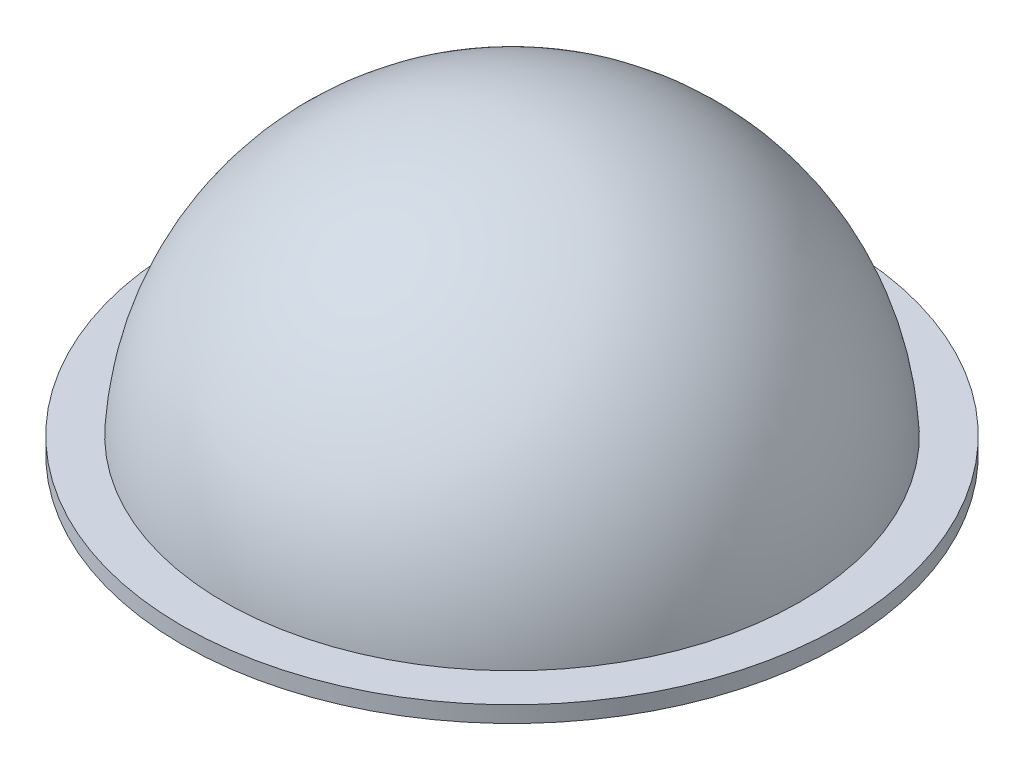
ISO-10303-21;
HEADER;
FILE_DESCRIPTION(('STEP AP214'),'2;1');
FILE_NAME('part.step','',(''),(''),'','','');
FILE_SCHEMA(('AUTOMOTIVE_DESIGN { 1 0 10303 214 1 1 1 1 }'));
ENDSEC;
DATA;
#1=APPLICATION_CONTEXT('core data for automotive mechanical design processes');
#2=APPLICATION_PROTOCOL_DEFINITION('international standard','automotive_design',2000,#1);
#3=PRODUCT_CONTEXT('',#1,'mechanical');
#4=PRODUCT('Part','Part','',(#3));
#5=PRODUCT_RELATED_PRODUCT_CATEGORY('part','',(#4));
#6=PRODUCT_DEFINITION_FORMATION('','',#4);
#7=PRODUCT_DEFINITION_CONTEXT('part definition',#1,'design');
#8=PRODUCT_DEFINITION('design','',#6,#7);
#9=PRODUCT_DEFINITION_SHAPE('','',#8);
#10=(LENGTH_UNIT() NAMED_UNIT(*) SI_UNIT(.MILLI.,.METRE.));
#11=(NAMED_UNIT(*) PLANE_ANGLE_UNIT() SI_UNIT($,.RADIAN.));
#12=(NAMED_UNIT(*) SI_UNIT($,.STERADIAN.) SOLID_ANGLE_UNIT());
#13=UNCERTAINTY_MEASURE_WITH_UNIT(LENGTH_MEASURE(1.E-05),#10,'distance_accuracy_value','');
#14=(GEOMETRIC_REPRESENTATION_CONTEXT(3) GLOBAL_UNCERTAINTY_ASSIGNED_CONTEXT((#13)) GLOBAL_UNIT_ASSIGNED_CONTEXT((#10,
#11,#12)) REPRESENTATION_CONTEXT('',''));
#15=CARTESIAN_POINT('',(0.,0.,0.));
#16=DIRECTION('',(0.,0.,1.));
#17=DIRECTION('',(1.,0.,0.));
#18=AXIS2_PLACEMENT_3D('',#15,#16,#17);
#19=CARTESIAN_POINT('',(-101.6,0.,0.));
#20=DIRECTION('',(0.,1.,0.));
#21=DIRECTION('',(-1.,0.,0.));
#22=AXIS2_PLACEMENT_3D('',#19,#20,#21);
#23=PLANE('',#22);
#24=CARTESIAN_POINT('',(0.,0.,0.));
#25=DIRECTION('',(0.,-1.,0.));
#26=DIRECTION('',(1.,0.,0.));
#27=AXIS2_PLACEMENT_3D('',#24,#25,#26);
#28=CIRCLE('',#27,85.725);
#29=CARTESIAN_POINT('',(85.725,0.,0.));
#30=VERTEX_POINT('',#29);
#31=EDGE_CURVE('E10',#30,#30,#28,.T.);
#32=ORIENTED_EDGE('',*,*,#31,.F.);
#33=EDGE_LOOP('',(#32));
#34=FACE_BOUND('',#33,.T.);
#35=CARTESIAN_POINT('',(0.,0.,0.));
#36=DIRECTION('',(0.,-1.,0.));
#37=DIRECTION('',(1.,0.,0.));
#38=AXIS2_PLACEMENT_3D('',#35,#36,#37);
#39=CIRCLE('',#38,101.6);
#40=CARTESIAN_POINT('',(101.6,0.,0.));
#41=VERTEX_POINT('',#40);
#42=EDGE_CURVE('E45',#41,#41,#39,.T.);
#43=ORIENTED_EDGE('',*,*,#42,.T.);
#44=EDGE_LOOP('',(#43));
#45=FACE_BOUND('',#44,.T.);
#46=ADVANCED_FACE('F31',(#34,#45),#23,.F.);
#47=CARTESIAN_POINT('',(0.,0.,0.));
#48=DIRECTION('',(0.,-1.,0.));
#49=DIRECTION('',(-1.,0.,0.));
#50=AXIS2_PLACEMENT_3D('',#47,#48,#49);
#51=SPHERICAL_SURFACE('',#50,85.725);
#52=ORIENTED_EDGE('',*,*,#31,.T.);
#53=EDGE_LOOP('',(#52));
#54=FACE_BOUND('',#53,.T.);
#55=ADVANCED_FACE('F65',(#54),#51,.F.);
#56=CARTESIAN_POINT('',(0.,0.,0.));
#57=DIRECTION('',(0.,-1.,0.));
#58=DIRECTION('',(-1.,0.,0.));
#59=AXIS2_PLACEMENT_3D('',#56,#57,#58);
#60=SPHERICAL_SURFACE('',#59,88.9);
#61=CARTESIAN_POINT('',(0.,5.,0.));
#62=DIRECTION('',(0.,-1.,0.));
#63=DIRECTION('',(1.,0.,0.));
#64=AXIS2_PLACEMENT_3D('',#61,#62,#63);
#65=CIRCLE('',#64,88.7592812048408);
#66=CARTESIAN_POINT('',(88.7592812048408,5.,0.));
#67=VERTEX_POINT('',#66);
#68=EDGE_CURVE('E37',#67,#67,#65,.T.);
#69=ORIENTED_EDGE('',*,*,#68,.F.);
#70=EDGE_LOOP('',(#69));
#71=FACE_BOUND('',#70,.T.);
#72=ADVANCED_FACE('F60',(#71),#60,.T.);
#73=CARTESIAN_POINT('',(-101.6,5.,0.));
#74=DIRECTION('',(0.,-1.,0.));
#75=DIRECTION('',(1.,0.,0.));
#76=AXIS2_PLACEMENT_3D('',#73,#74,#75);
#77=PLANE('',#76);
#78=CARTESIAN_POINT('',(0.,5.,0.));
#79=DIRECTION('',(0.,-1.,0.));
#80=DIRECTION('',(1.,0.,0.));
#81=AXIS2_PLACEMENT_3D('',#78,#79,#80);
#82=CIRCLE('',#81,101.6);
#83=CARTESIAN_POINT('',(101.6,5.,0.));
#84=VERTEX_POINT('',#83);
#85=EDGE_CURVE('E41',#84,#84,#82,.T.);
#86=ORIENTED_EDGE('',*,*,#85,.F.);
#87=EDGE_LOOP('',(#86));
#88=FACE_BOUND('',#87,.T.);
#89=ORIENTED_EDGE('',*,*,#68,.T.);
#90=EDGE_LOOP('',(#89));
#91=FACE_BOUND('',#90,.T.);
#92=ADVANCED_FACE('F55',(#88,#91),#77,.F.);
#93=CARTESIAN_POINT('',(0.,0.,0.));
#94=DIRECTION('',(0.,-1.,0.));
#95=DIRECTION('',(1.,0.,0.));
#96=AXIS2_PLACEMENT_3D('',#93,#94,#95);
#97=CYLINDRICAL_SURFACE('',#96,101.6);
#98=ORIENTED_EDGE('',*,*,#42,.F.);
#99=EDGE_LOOP('',(#98));
#100=FACE_BOUND('',#99,.T.);
#101=ORIENTED_EDGE('',*,*,#85,.T.);
#102=EDGE_LOOP('',(#101));
#103=FACE_BOUND('',#102,.T.);
#104=ADVANCED_FACE('F52',(#100,#103),#97,.T.);
#105=CLOSED_SHELL('',(#46,#55,#72,#92,#104));
#106=MANIFOLD_SOLID_BREP('B2',#105);
#107=ADVANCED_BREP_SHAPE_REPRESENTATION('',(#18,#106),#14);
#108=SHAPE_DEFINITION_REPRESENTATION(#9,#107);
ENDSEC;
END-ISO-10303-21;
